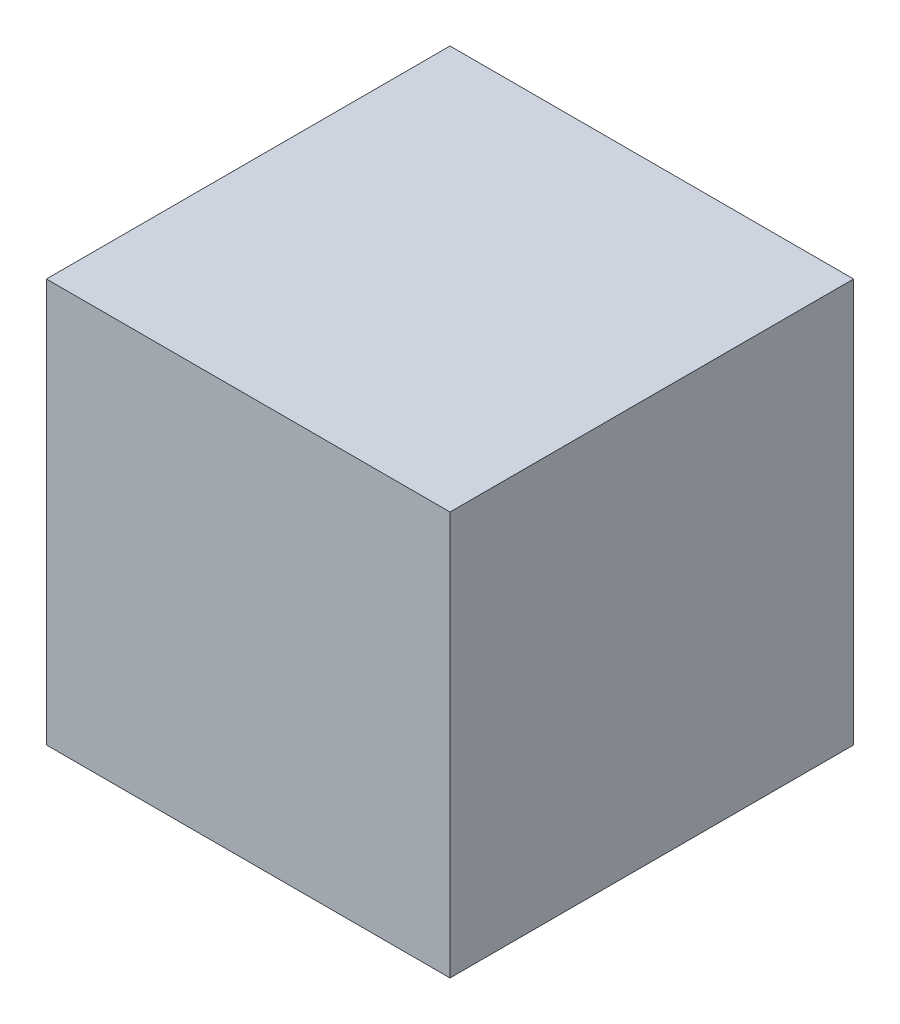
ISO-10303-21;
HEADER;
FILE_DESCRIPTION(('STEP AP214'),'2;1');
FILE_NAME('part.step','',(''),(''),'','','');
FILE_SCHEMA(('AUTOMOTIVE_DESIGN { 1 0 10303 214 1 1 1 1 }'));
ENDSEC;
DATA;
#1=APPLICATION_CONTEXT('core data for automotive mechanical design processes');
#2=APPLICATION_PROTOCOL_DEFINITION('international standard','automotive_design',2000,#1);
#3=PRODUCT_CONTEXT('',#1,'mechanical');
#4=PRODUCT('Part','Part','',(#3));
#5=PRODUCT_RELATED_PRODUCT_CATEGORY('part','',(#4));
#6=PRODUCT_DEFINITION_FORMATION('','',#4);
#7=PRODUCT_DEFINITION_CONTEXT('part definition',#1,'design');
#8=PRODUCT_DEFINITION('design','',#6,#7);
#9=PRODUCT_DEFINITION_SHAPE('','',#8);
#10=(LENGTH_UNIT() NAMED_UNIT(*) SI_UNIT(.MILLI.,.METRE.));
#11=(NAMED_UNIT(*) PLANE_ANGLE_UNIT() SI_UNIT($,.RADIAN.));
#12=(NAMED_UNIT(*) SI_UNIT($,.STERADIAN.) SOLID_ANGLE_UNIT());
#13=UNCERTAINTY_MEASURE_WITH_UNIT(LENGTH_MEASURE(1.E-05),#10,'distance_accuracy_value','');
#14=(GEOMETRIC_REPRESENTATION_CONTEXT(3) GLOBAL_UNCERTAINTY_ASSIGNED_CONTEXT((#13)) GLOBAL_UNIT_ASSIGNED_CONTEXT((#10,
#11,#12)) REPRESENTATION_CONTEXT('',''));
#15=CARTESIAN_POINT('',(0.,0.,0.));
#16=DIRECTION('',(0.,0.,1.));
#17=DIRECTION('',(1.,0.,0.));
#18=AXIS2_PLACEMENT_3D('',#15,#16,#17);
#19=CARTESIAN_POINT('',(28.25,28.25,28.25));
#20=DIRECTION('',(-1.,0.,0.));
#21=DIRECTION('',(0.,0.,1.));
#22=AXIS2_PLACEMENT_3D('',#19,#20,#21);
#23=PLANE('',#22);
#24=DIRECTION('',(0.,0.,-1.));
#25=VECTOR('',#24,1.);
#26=CARTESIAN_POINT('',(28.25,-28.25,28.25));
#27=LINE('',#26,#25);
#28=CARTESIAN_POINT('',(28.25,-28.25,28.25));
#29=VERTEX_POINT('',#28);
#30=CARTESIAN_POINT('',(28.25,-28.25,-28.25));
#31=VERTEX_POINT('',#30);
#32=EDGE_CURVE('E100',#29,#31,#27,.T.);
#33=ORIENTED_EDGE('',*,*,#32,.T.);
#34=DIRECTION('',(0.,-1.,0.));
#35=VECTOR('',#34,1.);
#36=CARTESIAN_POINT('',(28.25,28.25,-28.25));
#37=LINE('',#36,#35);
#38=CARTESIAN_POINT('',(28.25,28.25,-28.25));
#39=VERTEX_POINT('',#38);
#40=EDGE_CURVE('E11',#39,#31,#37,.T.);
#41=ORIENTED_EDGE('',*,*,#40,.F.);
#42=DIRECTION('',(0.,0.,-1.));
#43=VECTOR('',#42,1.);
#44=CARTESIAN_POINT('',(28.25,28.25,28.25));
#45=LINE('',#44,#43);
#46=CARTESIAN_POINT('',(28.25,28.25,28.25));
#47=VERTEX_POINT('',#46);
#48=EDGE_CURVE('E88',#47,#39,#45,.T.);
#49=ORIENTED_EDGE('',*,*,#48,.F.);
#50=DIRECTION('',(0.,-1.,0.));
#51=VECTOR('',#50,1.);
#52=CARTESIAN_POINT('',(28.25,28.25,28.25));
#53=LINE('',#52,#51);
#54=EDGE_CURVE('E96',#47,#29,#53,.T.);
#55=ORIENTED_EDGE('',*,*,#54,.T.);
#56=EDGE_LOOP('',(#33,#41,#49,#55));
#57=FACE_BOUND('',#56,.T.);
#58=ADVANCED_FACE('F37',(#57),#23,.F.);
#59=CARTESIAN_POINT('',(-28.25,28.25,-28.25));
#60=DIRECTION('',(0.,0.,1.));
#61=DIRECTION('',(1.,0.,0.));
#62=AXIS2_PLACEMENT_3D('',#59,#60,#61);
#63=PLANE('',#62);
#64=DIRECTION('',(-1.,0.,0.));
#65=VECTOR('',#64,1.);
#66=CARTESIAN_POINT('',(-28.25,-28.25,-28.25));
#67=LINE('',#66,#65);
#68=CARTESIAN_POINT('',(-28.25,-28.25,-28.25));
#69=VERTEX_POINT('',#68);
#70=EDGE_CURVE('E92',#31,#69,#67,.T.);
#71=ORIENTED_EDGE('',*,*,#70,.T.);
#72=DIRECTION('',(0.,-1.,0.));
#73=VECTOR('',#72,1.);
#74=CARTESIAN_POINT('',(-28.25,28.25,-28.25));
#75=LINE('',#74,#73);
#76=CARTESIAN_POINT('',(-28.25,28.25,-28.25));
#77=VERTEX_POINT('',#76);
#78=EDGE_CURVE('E45',#77,#69,#75,.T.);
#79=ORIENTED_EDGE('',*,*,#78,.F.);
#80=DIRECTION('',(-1.,0.,0.));
#81=VECTOR('',#80,1.);
#82=CARTESIAN_POINT('',(-28.25,28.25,-28.25));
#83=LINE('',#82,#81);
#84=EDGE_CURVE('E83',#39,#77,#83,.T.);
#85=ORIENTED_EDGE('',*,*,#84,.F.);
#86=ORIENTED_EDGE('',*,*,#40,.T.);
#87=EDGE_LOOP('',(#71,#79,#85,#86));
#88=FACE_BOUND('',#87,.T.);
#89=ADVANCED_FACE('F91',(#88),#63,.F.);
#90=CARTESIAN_POINT('',(-28.25,28.25,28.25));
#91=DIRECTION('',(1.,0.,0.));
#92=DIRECTION('',(0.,0.,-1.));
#93=AXIS2_PLACEMENT_3D('',#90,#91,#92);
#94=PLANE('',#93);
#95=DIRECTION('',(0.,0.,1.));
#96=VECTOR('',#95,1.);
#97=CARTESIAN_POINT('',(-28.25,-28.25,28.25));
#98=LINE('',#97,#96);
#99=CARTESIAN_POINT('',(-28.25,-28.25,28.25));
#100=VERTEX_POINT('',#99);
#101=EDGE_CURVE('E70',#69,#100,#98,.T.);
#102=ORIENTED_EDGE('',*,*,#101,.T.);
#103=DIRECTION('',(0.,-1.,0.));
#104=VECTOR('',#103,1.);
#105=CARTESIAN_POINT('',(-28.25,28.25,28.25));
#106=LINE('',#105,#104);
#107=CARTESIAN_POINT('',(-28.25,28.25,28.25));
#108=VERTEX_POINT('',#107);
#109=EDGE_CURVE('E93',#108,#100,#106,.T.);
#110=ORIENTED_EDGE('',*,*,#109,.F.);
#111=DIRECTION('',(0.,0.,1.));
#112=VECTOR('',#111,1.);
#113=CARTESIAN_POINT('',(-28.25,28.25,28.25));
#114=LINE('',#113,#112);
#115=EDGE_CURVE('E86',#77,#108,#114,.T.);
#116=ORIENTED_EDGE('',*,*,#115,.F.);
#117=ORIENTED_EDGE('',*,*,#78,.T.);
#118=EDGE_LOOP('',(#102,#110,#116,#117));
#119=FACE_BOUND('',#118,.T.);
#120=ADVANCED_FACE('F94',(#119),#94,.F.);
#121=CARTESIAN_POINT('',(-28.25,28.25,28.25));
#122=DIRECTION('',(0.,0.,-1.));
#123=DIRECTION('',(-1.,0.,0.));
#124=AXIS2_PLACEMENT_3D('',#121,#122,#123);
#125=PLANE('',#124);
#126=DIRECTION('',(1.,0.,0.));
#127=VECTOR('',#126,1.);
#128=CARTESIAN_POINT('',(-28.25,-28.25,28.25));
#129=LINE('',#128,#127);
#130=EDGE_CURVE('E76',#100,#29,#129,.T.);
#131=ORIENTED_EDGE('',*,*,#130,.T.);
#132=ORIENTED_EDGE('',*,*,#54,.F.);
#133=DIRECTION('',(1.,0.,0.));
#134=VECTOR('',#133,1.);
#135=CARTESIAN_POINT('',(-28.25,28.25,28.25));
#136=LINE('',#135,#134);
#137=EDGE_CURVE('E53',#108,#47,#136,.T.);
#138=ORIENTED_EDGE('',*,*,#137,.F.);
#139=ORIENTED_EDGE('',*,*,#109,.T.);
#140=EDGE_LOOP('',(#131,#132,#138,#139));
#141=FACE_BOUND('',#140,.T.);
#142=ADVANCED_FACE('F107',(#141),#125,.F.);
#143=CARTESIAN_POINT('',(0.,28.25,0.));
#144=DIRECTION('',(0.,-1.,0.));
#145=DIRECTION('',(0.,0.,-1.));
#146=AXIS2_PLACEMENT_3D('',#143,#144,#145);
#147=PLANE('',#146);
#148=ORIENTED_EDGE('',*,*,#48,.T.);
#149=ORIENTED_EDGE('',*,*,#84,.T.);
#150=ORIENTED_EDGE('',*,*,#115,.T.);
#151=ORIENTED_EDGE('',*,*,#137,.T.);
#152=EDGE_LOOP('',(#148,#149,#150,#151));
#153=FACE_BOUND('',#152,.T.);
#154=ADVANCED_FACE('F84',(#153),#147,.F.);
#155=CARTESIAN_POINT('',(0.,-28.25,0.));
#156=DIRECTION('',(0.,-1.,0.));
#157=DIRECTION('',(0.,0.,-1.));
#158=AXIS2_PLACEMENT_3D('',#155,#156,#157);
#159=PLANE('',#158);
#160=ORIENTED_EDGE('',*,*,#32,.F.);
#161=ORIENTED_EDGE('',*,*,#130,.F.);
#162=ORIENTED_EDGE('',*,*,#101,.F.);
#163=ORIENTED_EDGE('',*,*,#70,.F.);
#164=EDGE_LOOP('',(#160,#161,#162,#163));
#165=FACE_BOUND('',#164,.T.);
#166=ADVANCED_FACE('F110',(#165),#159,.T.);
#167=CLOSED_SHELL('',(#58,#89,#120,#142,#154,#166));
#168=MANIFOLD_SOLID_BREP('B2',#167);
#169=ADVANCED_BREP_SHAPE_REPRESENTATION('',(#18,#168),#14);
#170=SHAPE_DEFINITION_REPRESENTATION(#9,#169);
ENDSEC;
END-ISO-10303-21;
